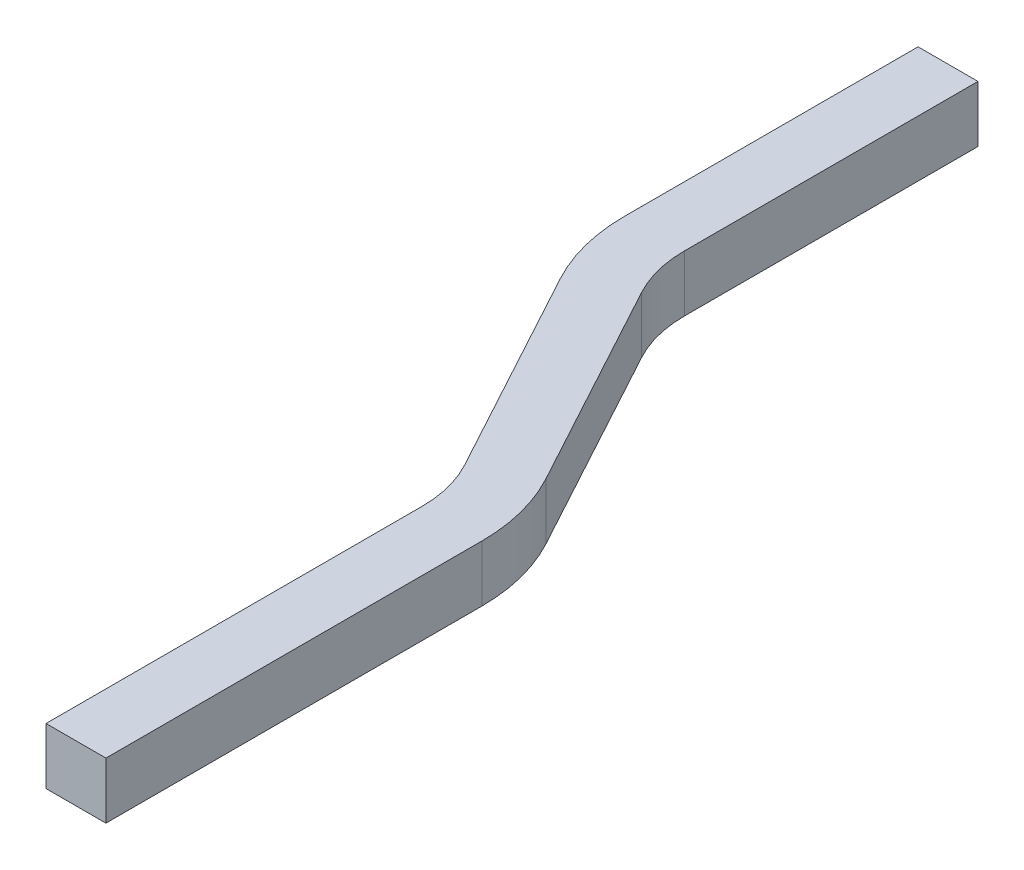
ISO-10303-21;
HEADER;
FILE_DESCRIPTION(('STEP AP214'),'2;1');
FILE_NAME('part.step','',(''),(''),'','','');
FILE_SCHEMA(('AUTOMOTIVE_DESIGN { 1 0 10303 214 1 1 1 1 }'));
ENDSEC;
DATA;
#1=APPLICATION_CONTEXT('core data for automotive mechanical design processes');
#2=APPLICATION_PROTOCOL_DEFINITION('international standard','automotive_design',2000,#1);
#3=PRODUCT_CONTEXT('',#1,'mechanical');
#4=PRODUCT('Part','Part','',(#3));
#5=PRODUCT_RELATED_PRODUCT_CATEGORY('part','',(#4));
#6=PRODUCT_DEFINITION_FORMATION('','',#4);
#7=PRODUCT_DEFINITION_CONTEXT('part definition',#1,'design');
#8=PRODUCT_DEFINITION('design','',#6,#7);
#9=PRODUCT_DEFINITION_SHAPE('','',#8);
#10=(LENGTH_UNIT() NAMED_UNIT(*) SI_UNIT(.MILLI.,.METRE.));
#11=(NAMED_UNIT(*) PLANE_ANGLE_UNIT() SI_UNIT($,.RADIAN.));
#12=(NAMED_UNIT(*) SI_UNIT($,.STERADIAN.) SOLID_ANGLE_UNIT());
#13=UNCERTAINTY_MEASURE_WITH_UNIT(LENGTH_MEASURE(1.E-05),#10,'distance_accuracy_value','');
#14=(GEOMETRIC_REPRESENTATION_CONTEXT(3) GLOBAL_UNCERTAINTY_ASSIGNED_CONTEXT((#13)) GLOBAL_UNIT_ASSIGNED_CONTEXT((#10,
#11,#12)) REPRESENTATION_CONTEXT('',''));
#15=CARTESIAN_POINT('',(0.,0.,0.));
#16=DIRECTION('',(0.,0.,1.));
#17=DIRECTION('',(1.,0.,0.));
#18=AXIS2_PLACEMENT_3D('',#15,#16,#17);
#19=CARTESIAN_POINT('',(-5.14500000000001,0.239999999999997,-1.59999999999999));
#20=DIRECTION('',(0.,-1.,0.));
#21=DIRECTION('',(0.,0.,-1.));
#22=AXIS2_PLACEMENT_3D('',#19,#20,#21);
#23=PLANE('',#22);
#24=DIRECTION('',(1.,0.,0.));
#25=VECTOR('',#24,1.);
#26=CARTESIAN_POINT('',(-5.4,0.240000000000001,0.));
#27=LINE('',#26,#25);
#28=CARTESIAN_POINT('',(-5.14500000000001,0.240000000000001,0.));
#29=VERTEX_POINT('',#28);
#30=CARTESIAN_POINT('',(-5.655,0.239999999999997,0.));
#31=VERTEX_POINT('',#30);
#32=EDGE_CURVE('E130',#29,#31,#27,.F.);
#33=ORIENTED_EDGE('',*,*,#32,.F.);
#34=DIRECTION('',(0.,0.,1.));
#35=VECTOR('',#34,1.);
#36=CARTESIAN_POINT('',(-5.14500000000001,0.240000000000001,-1.59999999999999));
#37=LINE('',#36,#35);
#38=CARTESIAN_POINT('',(-5.14500000000001,0.239999999999975,-3.19999999999997));
#39=VERTEX_POINT('',#38);
#40=EDGE_CURVE('E106',#29,#39,#37,.F.);
#41=ORIENTED_EDGE('',*,*,#40,.T.);
#42=CARTESIAN_POINT('',(-6.67652786543696,0.239999999999948,-3.19999999999998));
#43=DIRECTION('',(0.,-1.,0.));
#44=DIRECTION('',(0.,0.,-1.));
#45=AXIS2_PLACEMENT_3D('',#42,#43,#44);
#46=CIRCLE('',#45,1.53152786543694);
#47=CARTESIAN_POINT('',(-5.33050303889325,0.239999999999948,-3.93061259839792));
#48=VERTEX_POINT('',#47);
#49=EDGE_CURVE('E19',#48,#39,#46,.T.);
#50=ORIENTED_EDGE('',*,*,#49,.F.);
#51=DIRECTION('',(-0.477048191473493,0.,-0.878877137609046));
#52=VECTOR('',#51,1.);
#53=CARTESIAN_POINT('',(-6.29779748636311,0.239999999999948,-5.7126819792535));
#54=LINE('',#53,#52);
#55=CARTESIAN_POINT('',(-6.29779748636312,0.239999999999948,-5.7126819792535));
#56=VERTEX_POINT('',#55);
#57=EDGE_CURVE('E104',#56,#48,#54,.F.);
#58=ORIENTED_EDGE('',*,*,#57,.F.);
#59=CARTESIAN_POINT('',(-5.40000000000002,0.239999999999948,-6.19999999999997));
#60=DIRECTION('',(0.,1.,0.));
#61=DIRECTION('',(0.,0.,1.));
#62=AXIS2_PLACEMENT_3D('',#59,#60,#61);
#63=CIRCLE('',#62,1.02152786543694);
#64=CARTESIAN_POINT('',(-6.42152786543696,0.239999999999948,-6.19999999999997));
#65=VERTEX_POINT('',#64);
#66=EDGE_CURVE('E117',#56,#65,#63,.F.);
#67=ORIENTED_EDGE('',*,*,#66,.T.);
#68=DIRECTION('',(0.,0.,-1.));
#69=VECTOR('',#68,1.);
#70=CARTESIAN_POINT('',(-6.42152786543696,0.239999999999948,-8.69999999999996));
#71=LINE('',#70,#69);
#72=CARTESIAN_POINT('',(-6.42152786543696,0.239999999999948,-8.69999999999997));
#73=VERTEX_POINT('',#72);
#74=EDGE_CURVE('E155',#73,#65,#71,.F.);
#75=ORIENTED_EDGE('',*,*,#74,.F.);
#76=DIRECTION('',(1.,0.,0.));
#77=VECTOR('',#76,1.);
#78=CARTESIAN_POINT('',(-6.67652786543696,0.239999999999948,-8.69999999999997));
#79=LINE('',#78,#77);
#80=CARTESIAN_POINT('',(-6.93152786543696,0.239999999999951,-8.69999999999997));
#81=VERTEX_POINT('',#80);
#82=EDGE_CURVE('E152',#73,#81,#79,.F.);
#83=ORIENTED_EDGE('',*,*,#82,.T.);
#84=DIRECTION('',(0.,0.,1.));
#85=VECTOR('',#84,1.);
#86=CARTESIAN_POINT('',(-6.93152786543696,0.239999999999952,-8.69999999999997));
#87=LINE('',#86,#85);
#88=CARTESIAN_POINT('',(-6.93152786543696,0.239999999999952,-6.19999999999997));
#89=VERTEX_POINT('',#88);
#90=EDGE_CURVE('E146',#89,#81,#87,.F.);
#91=ORIENTED_EDGE('',*,*,#90,.F.);
#92=CARTESIAN_POINT('',(-5.40000000000002,0.239999999999952,-6.19999999999997));
#93=DIRECTION('',(0.,1.,0.));
#94=DIRECTION('',(0.,0.,1.));
#95=AXIS2_PLACEMENT_3D('',#92,#93,#94);
#96=CIRCLE('',#95,1.53152786543694);
#97=CARTESIAN_POINT('',(-6.74602482654373,0.239999999999952,-5.46938740160202));
#98=VERTEX_POINT('',#97);
#99=EDGE_CURVE('E181',#98,#89,#96,.F.);
#100=ORIENTED_EDGE('',*,*,#99,.F.);
#101=DIRECTION('',(0.477048191473493,0.,0.878877137609046));
#102=VECTOR('',#101,1.);
#103=CARTESIAN_POINT('',(-6.74602482654373,0.239999999999952,-5.46938740160202));
#104=LINE('',#103,#102);
#105=CARTESIAN_POINT('',(-5.77873037907387,0.239999999999952,-3.68731802074645));
#106=VERTEX_POINT('',#105);
#107=EDGE_CURVE('E142',#106,#98,#104,.F.);
#108=ORIENTED_EDGE('',*,*,#107,.F.);
#109=CARTESIAN_POINT('',(-6.67652786543696,0.239999999999952,-3.19999999999998));
#110=DIRECTION('',(0.,-1.,0.));
#111=DIRECTION('',(0.,0.,-1.));
#112=AXIS2_PLACEMENT_3D('',#109,#110,#111);
#113=CIRCLE('',#112,1.02152786543694);
#114=CARTESIAN_POINT('',(-5.65500000000001,0.23999999999997,-3.19999999999998));
#115=VERTEX_POINT('',#114);
#116=EDGE_CURVE('E139',#106,#115,#113,.T.);
#117=ORIENTED_EDGE('',*,*,#116,.T.);
#118=DIRECTION('',(0.,0.,-1.));
#119=VECTOR('',#118,1.);
#120=CARTESIAN_POINT('',(-5.65500000000001,0.239999999999988,-1.59999999999999));
#121=LINE('',#120,#119);
#122=EDGE_CURVE('E136',#115,#31,#121,.F.);
#123=ORIENTED_EDGE('',*,*,#122,.T.);
#124=EDGE_LOOP('',(#33,#41,#50,#58,#67,#75,#83,#91,#100,#108,#117,#123));
#125=FACE_BOUND('',#124,.T.);
#126=ADVANCED_FACE('F16',(#125),#23,.F.);
#127=CARTESIAN_POINT('',(-6.67652786543696,1.59317E-13,-3.19999999999998));
#128=DIRECTION('',(0.,-1.,0.));
#129=DIRECTION('',(0.,0.,-1.));
#130=AXIS2_PLACEMENT_3D('',#127,#128,#129);
#131=CYLINDRICAL_SURFACE('',#130,1.53152786543694);
#132=DIRECTION('',(0.,1.,0.));
#133=VECTOR('',#132,1.);
#134=CARTESIAN_POINT('',(-5.33050303889325,0.239999999999948,-3.93061259839792));
#135=LINE('',#134,#133);
#136=CARTESIAN_POINT('',(-5.33050303889325,-0.240000000000008,-3.93061259839792));
#137=VERTEX_POINT('',#136);
#138=EDGE_CURVE('E111',#48,#137,#135,.F.);
#139=ORIENTED_EDGE('',*,*,#138,.F.);
#140=ORIENTED_EDGE('',*,*,#49,.T.);
#141=DIRECTION('',(0.,1.,0.));
#142=VECTOR('',#141,1.);
#143=CARTESIAN_POINT('',(-5.14500000000001,-0.240000000000003,-3.19999999999997));
#144=LINE('',#143,#142);
#145=CARTESIAN_POINT('',(-5.145,-0.240000000000008,-3.19999999999997));
#146=VERTEX_POINT('',#145);
#147=EDGE_CURVE('E127',#39,#146,#144,.F.);
#148=ORIENTED_EDGE('',*,*,#147,.T.);
#149=CARTESIAN_POINT('',(-6.67652786543696,-0.240000000000012,-3.19999999999998));
#150=DIRECTION('',(0.,-1.,0.));
#151=DIRECTION('',(0.,0.,-1.));
#152=AXIS2_PLACEMENT_3D('',#149,#150,#151);
#153=CIRCLE('',#152,1.53152786543694);
#154=EDGE_CURVE('E121',#146,#137,#153,.F.);
#155=ORIENTED_EDGE('',*,*,#154,.T.);
#156=EDGE_LOOP('',(#139,#140,#148,#155));
#157=FACE_BOUND('',#156,.T.);
#158=ADVANCED_FACE('F120',(#157),#131,.T.);
#159=CARTESIAN_POINT('',(-6.29779748636311,0.239999999999948,-5.7126819792535));
#160=DIRECTION('',(0.878877137609046,0.,-0.477048191473493));
#161=DIRECTION('',(-0.477048191473493,0.,-0.878877137609046));
#162=AXIS2_PLACEMENT_3D('',#159,#160,#161);
#163=PLANE('',#162);
#164=DIRECTION('',(0.,1.,0.));
#165=VECTOR('',#164,1.);
#166=CARTESIAN_POINT('',(-6.29779748636312,1.59317E-13,-5.7126819792535));
#167=LINE('',#166,#165);
#168=CARTESIAN_POINT('',(-6.29779748636312,-0.239999999999816,-5.7126819792535));
#169=VERTEX_POINT('',#168);
#170=EDGE_CURVE('E116',#169,#56,#167,.T.);
#171=ORIENTED_EDGE('',*,*,#170,.T.);
#172=ORIENTED_EDGE('',*,*,#57,.T.);
#173=ORIENTED_EDGE('',*,*,#138,.T.);
#174=DIRECTION('',(-0.477048191473494,0.,-0.878877137609045));
#175=VECTOR('',#174,1.);
#176=CARTESIAN_POINT('',(-5.33050303889325,-0.240000000000003,-3.93061259839793));
#177=LINE('',#176,#175);
#178=EDGE_CURVE('E176',#137,#169,#177,.T.);
#179=ORIENTED_EDGE('',*,*,#178,.T.);
#180=EDGE_LOOP('',(#171,#172,#173,#179));
#181=FACE_BOUND('',#180,.T.);
#182=ADVANCED_FACE('F113',(#181),#163,.T.);
#183=CARTESIAN_POINT('',(-5.40000000000002,1.59317E-13,-6.19999999999997));
#184=DIRECTION('',(0.,1.,0.));
#185=DIRECTION('',(0.,0.,1.));
#186=AXIS2_PLACEMENT_3D('',#183,#184,#185);
#187=CYLINDRICAL_SURFACE('',#186,1.02152786543694);
#188=CARTESIAN_POINT('',(-5.40000000000002,-0.239999999999629,-6.19999999999997));
#189=DIRECTION('',(0.,1.,0.));
#190=DIRECTION('',(0.,0.,1.));
#191=AXIS2_PLACEMENT_3D('',#188,#189,#190);
#192=CIRCLE('',#191,1.02152786543694);
#193=CARTESIAN_POINT('',(-6.42152786543696,-0.239999999999816,-6.19999999999997));
#194=VERTEX_POINT('',#193);
#195=EDGE_CURVE('E172',#169,#194,#192,.F.);
#196=ORIENTED_EDGE('',*,*,#195,.T.);
#197=DIRECTION('',(0.,1.,0.));
#198=VECTOR('',#197,1.);
#199=CARTESIAN_POINT('',(-6.42152786543696,0.239999999999948,-6.19999999999997));
#200=LINE('',#199,#198);
#201=EDGE_CURVE('E160',#65,#194,#200,.F.);
#202=ORIENTED_EDGE('',*,*,#201,.F.);
#203=ORIENTED_EDGE('',*,*,#66,.F.);
#204=ORIENTED_EDGE('',*,*,#170,.F.);
#205=EDGE_LOOP('',(#196,#202,#203,#204));
#206=FACE_BOUND('',#205,.T.);
#207=ADVANCED_FACE('F263',(#206),#187,.F.);
#208=CARTESIAN_POINT('',(-6.42152786543696,0.239999999999948,-8.69999999999996));
#209=DIRECTION('',(1.,0.,0.));
#210=DIRECTION('',(0.,0.,-1.));
#211=AXIS2_PLACEMENT_3D('',#208,#209,#210);
#212=PLANE('',#211);
#213=DIRECTION('',(0.,1.,0.));
#214=VECTOR('',#213,1.);
#215=CARTESIAN_POINT('',(-6.42152786543696,1.612079E-13,-8.69999999999997));
#216=LINE('',#215,#214);
#217=CARTESIAN_POINT('',(-6.42152786543696,-0.240000000000003,-8.69999999999997));
#218=VERTEX_POINT('',#217);
#219=EDGE_CURVE('E149',#218,#73,#216,.T.);
#220=ORIENTED_EDGE('',*,*,#219,.T.);
#221=ORIENTED_EDGE('',*,*,#74,.T.);
#222=ORIENTED_EDGE('',*,*,#201,.T.);
#223=DIRECTION('',(0.,0.,1.));
#224=VECTOR('',#223,1.);
#225=CARTESIAN_POINT('',(-6.42152786543696,-0.240000000000003,-1.59999999999999));
#226=LINE('',#225,#224);
#227=EDGE_CURVE('E175',#194,#218,#226,.F.);
#228=ORIENTED_EDGE('',*,*,#227,.T.);
#229=EDGE_LOOP('',(#220,#221,#222,#228));
#230=FACE_BOUND('',#229,.T.);
#231=ADVANCED_FACE('F260',(#230),#212,.T.);
#232=CARTESIAN_POINT('',(-6.67652786543696,1.612079E-13,-8.69999999999997));
#233=DIRECTION('',(0.,0.,1.));
#234=DIRECTION('',(1.,0.,0.));
#235=AXIS2_PLACEMENT_3D('',#232,#233,#234);
#236=PLANE('',#235);
#237=DIRECTION('',(1.,0.,0.));
#238=VECTOR('',#237,1.);
#239=CARTESIAN_POINT('',(-5.14500000000001,-0.240000000000003,-8.69999999999997));
#240=LINE('',#239,#238);
#241=CARTESIAN_POINT('',(-6.93152786543696,-0.240000000000003,-8.69999999999997));
#242=VERTEX_POINT('',#241);
#243=EDGE_CURVE('E194',#218,#242,#240,.F.);
#244=ORIENTED_EDGE('',*,*,#243,.T.);
#245=DIRECTION('',(0.,1.,0.));
#246=VECTOR('',#245,1.);
#247=CARTESIAN_POINT('',(-6.93152786543696,-0.239999999999626,-8.69999999999996));
#248=LINE('',#247,#246);
#249=EDGE_CURVE('E148',#81,#242,#248,.F.);
#250=ORIENTED_EDGE('',*,*,#249,.F.);
#251=ORIENTED_EDGE('',*,*,#82,.F.);
#252=ORIENTED_EDGE('',*,*,#219,.F.);
#253=EDGE_LOOP('',(#244,#250,#251,#252));
#254=FACE_BOUND('',#253,.T.);
#255=ADVANCED_FACE('F259',(#254),#236,.F.);
#256=CARTESIAN_POINT('',(-6.93152786543696,-0.239999999999626,-8.69999999999997));
#257=DIRECTION('',(-1.,0.,0.));
#258=DIRECTION('',(0.,0.,1.));
#259=AXIS2_PLACEMENT_3D('',#256,#257,#258);
#260=PLANE('',#259);
#261=ORIENTED_EDGE('',*,*,#249,.T.);
#262=DIRECTION('',(0.,0.,1.));
#263=VECTOR('',#262,1.);
#264=CARTESIAN_POINT('',(-6.93152786543696,-0.240000000000003,-1.59999999999999));
#265=LINE('',#264,#263);
#266=CARTESIAN_POINT('',(-6.93152786543696,-0.239999999999815,-6.19999999999997));
#267=VERTEX_POINT('',#266);
#268=EDGE_CURVE('E171',#242,#267,#265,.T.);
#269=ORIENTED_EDGE('',*,*,#268,.T.);
#270=DIRECTION('',(0.,1.,0.));
#271=VECTOR('',#270,1.);
#272=CARTESIAN_POINT('',(-6.93152786543696,1.628558E-13,-6.19999999999997));
#273=LINE('',#272,#271);
#274=EDGE_CURVE('E145',#89,#267,#273,.F.);
#275=ORIENTED_EDGE('',*,*,#274,.F.);
#276=ORIENTED_EDGE('',*,*,#90,.T.);
#277=EDGE_LOOP('',(#261,#269,#275,#276));
#278=FACE_BOUND('',#277,.T.);
#279=ADVANCED_FACE('F255',(#278),#260,.T.);
#280=CARTESIAN_POINT('',(-5.40000000000002,1.628558E-13,-6.19999999999997));
#281=DIRECTION('',(0.,1.,0.));
#282=DIRECTION('',(0.,0.,1.));
#283=AXIS2_PLACEMENT_3D('',#280,#281,#282);
#284=CYLINDRICAL_SURFACE('',#283,1.53152786543694);
#285=ORIENTED_EDGE('',*,*,#274,.T.);
#286=CARTESIAN_POINT('',(-5.40000000000002,-0.239999999999626,-6.19999999999997));
#287=DIRECTION('',(0.,1.,0.));
#288=DIRECTION('',(0.,0.,1.));
#289=AXIS2_PLACEMENT_3D('',#286,#287,#288);
#290=CIRCLE('',#289,1.53152786543694);
#291=CARTESIAN_POINT('',(-6.74602482654373,-0.239999999999815,-5.46938740160202));
#292=VERTEX_POINT('',#291);
#293=EDGE_CURVE('E168',#267,#292,#290,.T.);
#294=ORIENTED_EDGE('',*,*,#293,.T.);
#295=DIRECTION('',(0.,1.,0.));
#296=VECTOR('',#295,1.);
#297=CARTESIAN_POINT('',(-6.74602482654373,-0.239999999999626,-5.46938740160201));
#298=LINE('',#297,#296);
#299=EDGE_CURVE('E144',#98,#292,#298,.F.);
#300=ORIENTED_EDGE('',*,*,#299,.F.);
#301=ORIENTED_EDGE('',*,*,#99,.T.);
#302=EDGE_LOOP('',(#285,#294,#300,#301));
#303=FACE_BOUND('',#302,.T.);
#304=ADVANCED_FACE('F251',(#303),#284,.T.);
#305=CARTESIAN_POINT('',(-6.74602482654373,-0.239999999999626,-5.46938740160202));
#306=DIRECTION('',(-0.878877137609046,0.,0.477048191473493));
#307=DIRECTION('',(0.477048191473493,0.,0.878877137609046));
#308=AXIS2_PLACEMENT_3D('',#305,#306,#307);
#309=PLANE('',#308);
#310=ORIENTED_EDGE('',*,*,#299,.T.);
#311=DIRECTION('',(0.477048191473493,0.,0.878877137609046));
#312=VECTOR('',#311,1.);
#313=CARTESIAN_POINT('',(-6.74602482654373,-0.240000000000003,-5.46938740160202));
#314=LINE('',#313,#312);
#315=CARTESIAN_POINT('',(-5.77873037907387,-0.240000000000006,-3.68731802074645));
#316=VERTEX_POINT('',#315);
#317=EDGE_CURVE('E167',#292,#316,#314,.T.);
#318=ORIENTED_EDGE('',*,*,#317,.T.);
#319=DIRECTION('',(0.,-1.,0.));
#320=VECTOR('',#319,1.);
#321=CARTESIAN_POINT('',(-5.77873037907387,1.628558E-13,-3.68731802074645));
#322=LINE('',#321,#320);
#323=EDGE_CURVE('E180',#316,#106,#322,.F.);
#324=ORIENTED_EDGE('',*,*,#323,.T.);
#325=ORIENTED_EDGE('',*,*,#107,.T.);
#326=EDGE_LOOP('',(#310,#318,#324,#325));
#327=FACE_BOUND('',#326,.T.);
#328=ADVANCED_FACE('F245',(#327),#309,.T.);
#329=CARTESIAN_POINT('',(-6.67652786543696,1.628558E-13,-3.19999999999998));
#330=DIRECTION('',(0.,-1.,0.));
#331=DIRECTION('',(0.,0.,-1.));
#332=AXIS2_PLACEMENT_3D('',#329,#330,#331);
#333=CYLINDRICAL_SURFACE('',#332,1.02152786543694);
#334=ORIENTED_EDGE('',*,*,#116,.F.);
#335=ORIENTED_EDGE('',*,*,#323,.F.);
#336=CARTESIAN_POINT('',(-6.67652786543696,-0.24000000000001,-3.19999999999998));
#337=DIRECTION('',(0.,-1.,0.));
#338=DIRECTION('',(0.,0.,-1.));
#339=AXIS2_PLACEMENT_3D('',#336,#337,#338);
#340=CIRCLE('',#339,1.02152786543694);
#341=CARTESIAN_POINT('',(-5.65500000000002,-0.24000000000001,-3.19999999999998));
#342=VERTEX_POINT('',#341);
#343=EDGE_CURVE('E163',#316,#342,#340,.T.);
#344=ORIENTED_EDGE('',*,*,#343,.T.);
#345=DIRECTION('',(0.,1.,0.));
#346=VECTOR('',#345,1.);
#347=CARTESIAN_POINT('',(-5.65500000000001,-0.240000000000003,-3.19999999999998));
#348=LINE('',#347,#346);
#349=EDGE_CURVE('E138',#342,#115,#348,.T.);
#350=ORIENTED_EDGE('',*,*,#349,.T.);
#351=EDGE_LOOP('',(#334,#335,#344,#350));
#352=FACE_BOUND('',#351,.T.);
#353=ADVANCED_FACE('F243',(#352),#333,.F.);
#354=CARTESIAN_POINT('',(-5.65500000000001,-0.240000000000003,-1.59999999999999));
#355=DIRECTION('',(1.,0.,0.));
#356=DIRECTION('',(0.,0.,-1.));
#357=AXIS2_PLACEMENT_3D('',#354,#355,#356);
#358=PLANE('',#357);
#359=DIRECTION('',(0.,0.,1.));
#360=VECTOR('',#359,1.);
#361=CARTESIAN_POINT('',(-5.65500000000002,-0.240000000000003,-1.59999999999999));
#362=LINE('',#361,#360);
#363=CARTESIAN_POINT('',(-5.65500000000001,-0.240000000000003,0.));
#364=VERTEX_POINT('',#363);
#365=EDGE_CURVE('E166',#342,#364,#362,.T.);
#366=ORIENTED_EDGE('',*,*,#365,.T.);
#367=DIRECTION('',(0.,1.,0.));
#368=VECTOR('',#367,1.);
#369=CARTESIAN_POINT('',(-5.655,-0.24,0.));
#370=LINE('',#369,#368);
#371=EDGE_CURVE('E133',#31,#364,#370,.F.);
#372=ORIENTED_EDGE('',*,*,#371,.F.);
#373=ORIENTED_EDGE('',*,*,#122,.F.);
#374=ORIENTED_EDGE('',*,*,#349,.F.);
#375=EDGE_LOOP('',(#366,#372,#373,#374));
#376=FACE_BOUND('',#375,.T.);
#377=ADVANCED_FACE('F235',(#376),#358,.F.);
#378=CARTESIAN_POINT('',(-5.4,-0.24,0.));
#379=DIRECTION('',(0.,0.,1.));
#380=DIRECTION('',(1.,0.,0.));
#381=AXIS2_PLACEMENT_3D('',#378,#379,#380);
#382=PLANE('',#381);
#383=DIRECTION('',(0.,1.,0.));
#384=VECTOR('',#383,1.);
#385=CARTESIAN_POINT('',(-5.14500000000001,-0.240000000000003,0.));
#386=LINE('',#385,#384);
#387=CARTESIAN_POINT('',(-5.145,-0.240000000000003,0.));
#388=VERTEX_POINT('',#387);
#389=EDGE_CURVE('E33',#388,#29,#386,.T.);
#390=ORIENTED_EDGE('',*,*,#389,.T.);
#391=ORIENTED_EDGE('',*,*,#32,.T.);
#392=ORIENTED_EDGE('',*,*,#371,.T.);
#393=DIRECTION('',(1.,0.,0.));
#394=VECTOR('',#393,1.);
#395=CARTESIAN_POINT('',(-5.14500000000001,-0.240000000000003,0.));
#396=LINE('',#395,#394);
#397=EDGE_CURVE('E25',#364,#388,#396,.T.);
#398=ORIENTED_EDGE('',*,*,#397,.T.);
#399=EDGE_LOOP('',(#390,#391,#392,#398));
#400=FACE_BOUND('',#399,.T.);
#401=ADVANCED_FACE('F279',(#400),#382,.T.);
#402=CARTESIAN_POINT('',(-5.14500000000001,-0.240000000000003,-1.59999999999999));
#403=DIRECTION('',(-1.,0.,0.));
#404=DIRECTION('',(0.,0.,1.));
#405=AXIS2_PLACEMENT_3D('',#402,#403,#404);
#406=PLANE('',#405);
#407=ORIENTED_EDGE('',*,*,#40,.F.);
#408=ORIENTED_EDGE('',*,*,#389,.F.);
#409=DIRECTION('',(0.,0.,1.));
#410=VECTOR('',#409,1.);
#411=CARTESIAN_POINT('',(-5.145,-0.240000000000003,-1.59999999999999));
#412=LINE('',#411,#410);
#413=EDGE_CURVE('E10',#388,#146,#412,.F.);
#414=ORIENTED_EDGE('',*,*,#413,.T.);
#415=ORIENTED_EDGE('',*,*,#147,.F.);
#416=EDGE_LOOP('',(#407,#408,#414,#415));
#417=FACE_BOUND('',#416,.T.);
#418=ADVANCED_FACE('F274',(#417),#406,.F.);
#419=CARTESIAN_POINT('',(-5.14500000000001,-0.240000000000003,-1.59999999999999));
#420=DIRECTION('',(0.,1.,0.));
#421=DIRECTION('',(0.,0.,1.));
#422=AXIS2_PLACEMENT_3D('',#419,#420,#421);
#423=PLANE('',#422);
#424=ORIENTED_EDGE('',*,*,#397,.F.);
#425=ORIENTED_EDGE('',*,*,#365,.F.);
#426=ORIENTED_EDGE('',*,*,#343,.F.);
#427=ORIENTED_EDGE('',*,*,#317,.F.);
#428=ORIENTED_EDGE('',*,*,#293,.F.);
#429=ORIENTED_EDGE('',*,*,#268,.F.);
#430=ORIENTED_EDGE('',*,*,#243,.F.);
#431=ORIENTED_EDGE('',*,*,#227,.F.);
#432=ORIENTED_EDGE('',*,*,#195,.F.);
#433=ORIENTED_EDGE('',*,*,#178,.F.);
#434=ORIENTED_EDGE('',*,*,#154,.F.);
#435=ORIENTED_EDGE('',*,*,#413,.F.);
#436=EDGE_LOOP('',(#424,#425,#426,#427,#428,#429,#430,#431,#432,#433,#434,#435));
#437=FACE_BOUND('',#436,.T.);
#438=ADVANCED_FACE('F239',(#437),#423,.F.);
#439=CLOSED_SHELL('',(#126,#158,#182,#207,#231,#255,#279,#304,#328,#353,#377,#401,#418,#438));
#440=MANIFOLD_SOLID_BREP('B1',#439);
#441=ADVANCED_BREP_SHAPE_REPRESENTATION('',(#18,#440),#14);
#442=SHAPE_DEFINITION_REPRESENTATION(#9,#441);
ENDSEC;
END-ISO-10303-21;
